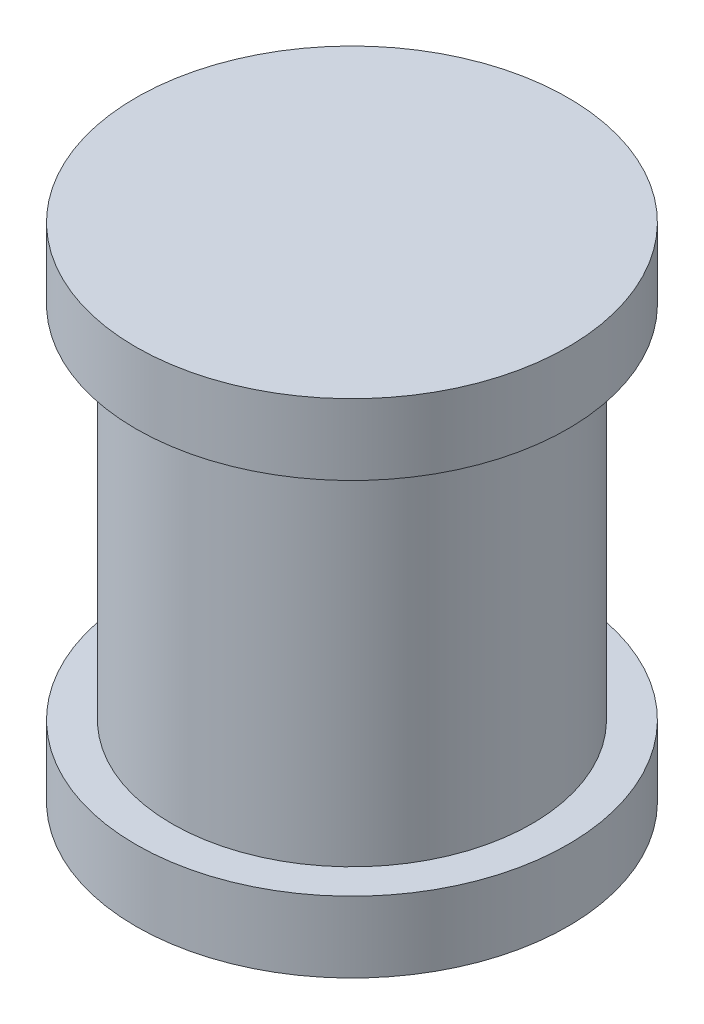
ISO-10303-21;
HEADER;
FILE_DESCRIPTION(('STEP AP214'),'2;1');
FILE_NAME('part.step','',(''),(''),'','','');
FILE_SCHEMA(('AUTOMOTIVE_DESIGN { 1 0 10303 214 1 1 1 1 }'));
ENDSEC;
DATA;
#1=APPLICATION_CONTEXT('core data for automotive mechanical design processes');
#2=APPLICATION_PROTOCOL_DEFINITION('international standard','automotive_design',2000,#1);
#3=PRODUCT_CONTEXT('',#1,'mechanical');
#4=PRODUCT('Part','Part','',(#3));
#5=PRODUCT_RELATED_PRODUCT_CATEGORY('part','',(#4));
#6=PRODUCT_DEFINITION_FORMATION('','',#4);
#7=PRODUCT_DEFINITION_CONTEXT('part definition',#1,'design');
#8=PRODUCT_DEFINITION('design','',#6,#7);
#9=PRODUCT_DEFINITION_SHAPE('','',#8);
#10=(LENGTH_UNIT() NAMED_UNIT(*) SI_UNIT(.MILLI.,.METRE.));
#11=(NAMED_UNIT(*) PLANE_ANGLE_UNIT() SI_UNIT($,.RADIAN.));
#12=(NAMED_UNIT(*) SI_UNIT($,.STERADIAN.) SOLID_ANGLE_UNIT());
#13=UNCERTAINTY_MEASURE_WITH_UNIT(LENGTH_MEASURE(1.E-05),#10,'distance_accuracy_value','');
#14=(GEOMETRIC_REPRESENTATION_CONTEXT(3) GLOBAL_UNCERTAINTY_ASSIGNED_CONTEXT((#13)) GLOBAL_UNIT_ASSIGNED_CONTEXT((#10,
#11,#12)) REPRESENTATION_CONTEXT('',''));
#15=CARTESIAN_POINT('',(0.,0.,0.));
#16=DIRECTION('',(0.,0.,1.));
#17=DIRECTION('',(1.,0.,0.));
#18=AXIS2_PLACEMENT_3D('',#15,#16,#17);
#19=CARTESIAN_POINT('',(0.,12.7,0.));
#20=DIRECTION('',(0.,-1.,0.));
#21=DIRECTION('',(0.,0.,-1.));
#22=AXIS2_PLACEMENT_3D('',#19,#20,#21);
#23=CYLINDRICAL_SURFACE('',#22,12.7);
#24=CARTESIAN_POINT('',(0.,12.7,0.));
#25=DIRECTION('',(0.,1.,0.));
#26=DIRECTION('',(0.,0.,1.));
#27=AXIS2_PLACEMENT_3D('',#24,#25,#26);
#28=CIRCLE('',#27,12.7);
#29=CARTESIAN_POINT('',(0.,12.7,12.7));
#30=VERTEX_POINT('',#29);
#31=EDGE_CURVE('E10',#30,#30,#28,.T.);
#32=ORIENTED_EDGE('',*,*,#31,.F.);
#33=EDGE_LOOP('',(#32));
#34=FACE_BOUND('',#33,.T.);
#35=CARTESIAN_POINT('',(0.,-12.7,0.));
#36=DIRECTION('',(0.,1.,0.));
#37=DIRECTION('',(0.,0.,1.));
#38=AXIS2_PLACEMENT_3D('',#35,#36,#37);
#39=CIRCLE('',#38,12.7);
#40=CARTESIAN_POINT('',(0.,-12.7,12.7));
#41=VERTEX_POINT('',#40);
#42=EDGE_CURVE('E35',#41,#41,#39,.T.);
#43=ORIENTED_EDGE('',*,*,#42,.T.);
#44=EDGE_LOOP('',(#43));
#45=FACE_BOUND('',#44,.T.);
#46=ADVANCED_FACE('F32',(#34,#45),#23,.T.);
#47=CARTESIAN_POINT('',(0.,17.7,0.));
#48=DIRECTION('',(0.,-1.,0.));
#49=DIRECTION('',(0.,0.,-1.));
#50=AXIS2_PLACEMENT_3D('',#47,#48,#49);
#51=CYLINDRICAL_SURFACE('',#50,15.24);
#52=CARTESIAN_POINT('',(0.,17.7,0.));
#53=DIRECTION('',(0.,1.,0.));
#54=DIRECTION('',(0.,0.,1.));
#55=AXIS2_PLACEMENT_3D('',#52,#53,#54);
#56=CIRCLE('',#55,15.24);
#57=CARTESIAN_POINT('',(0.,17.7,15.24));
#58=VERTEX_POINT('',#57);
#59=EDGE_CURVE('E39',#58,#58,#56,.T.);
#60=ORIENTED_EDGE('',*,*,#59,.F.);
#61=EDGE_LOOP('',(#60));
#62=FACE_BOUND('',#61,.T.);
#63=CARTESIAN_POINT('',(0.,12.7,0.));
#64=DIRECTION('',(0.,1.,0.));
#65=DIRECTION('',(0.,0.,1.));
#66=AXIS2_PLACEMENT_3D('',#63,#64,#65);
#67=CIRCLE('',#66,15.24);
#68=CARTESIAN_POINT('',(0.,12.7,15.24));
#69=VERTEX_POINT('',#68);
#70=EDGE_CURVE('E43',#69,#69,#67,.T.);
#71=ORIENTED_EDGE('',*,*,#70,.T.);
#72=EDGE_LOOP('',(#71));
#73=FACE_BOUND('',#72,.T.);
#74=ADVANCED_FACE('F80',(#62,#73),#51,.T.);
#75=CARTESIAN_POINT('',(0.,17.7,0.));
#76=DIRECTION('',(0.,1.,0.));
#77=DIRECTION('',(0.,0.,1.));
#78=AXIS2_PLACEMENT_3D('',#75,#76,#77);
#79=PLANE('',#78);
#80=ORIENTED_EDGE('',*,*,#59,.T.);
#81=EDGE_LOOP('',(#80));
#82=FACE_BOUND('',#81,.T.);
#83=ADVANCED_FACE('F76',(#82),#79,.T.);
#84=CARTESIAN_POINT('',(0.,12.7,0.));
#85=DIRECTION('',(0.,1.,0.));
#86=DIRECTION('',(0.,0.,1.));
#87=AXIS2_PLACEMENT_3D('',#84,#85,#86);
#88=PLANE('',#87);
#89=ORIENTED_EDGE('',*,*,#31,.T.);
#90=EDGE_LOOP('',(#89));
#91=FACE_BOUND('',#90,.T.);
#92=ORIENTED_EDGE('',*,*,#70,.F.);
#93=EDGE_LOOP('',(#92));
#94=FACE_BOUND('',#93,.T.);
#95=ADVANCED_FACE('F68',(#91,#94),#88,.F.);
#96=CARTESIAN_POINT('',(0.,-17.7,0.));
#97=DIRECTION('',(0.,1.,0.));
#98=DIRECTION('',(0.,0.,1.));
#99=AXIS2_PLACEMENT_3D('',#96,#97,#98);
#100=CYLINDRICAL_SURFACE('',#99,15.24);
#101=CARTESIAN_POINT('',(0.,-17.7,0.));
#102=DIRECTION('',(0.,1.,0.));
#103=DIRECTION('',(0.,0.,1.));
#104=AXIS2_PLACEMENT_3D('',#101,#102,#103);
#105=CIRCLE('',#104,15.24);
#106=CARTESIAN_POINT('',(0.,-17.7,15.24));
#107=VERTEX_POINT('',#106);
#108=EDGE_CURVE('E51',#107,#107,#105,.T.);
#109=ORIENTED_EDGE('',*,*,#108,.T.);
#110=EDGE_LOOP('',(#109));
#111=FACE_BOUND('',#110,.T.);
#112=CARTESIAN_POINT('',(0.,-12.7,0.));
#113=DIRECTION('',(0.,1.,0.));
#114=DIRECTION('',(0.,0.,1.));
#115=AXIS2_PLACEMENT_3D('',#112,#113,#114);
#116=CIRCLE('',#115,15.24);
#117=CARTESIAN_POINT('',(0.,-12.7,15.24));
#118=VERTEX_POINT('',#117);
#119=EDGE_CURVE('E48',#118,#118,#116,.T.);
#120=ORIENTED_EDGE('',*,*,#119,.F.);
#121=EDGE_LOOP('',(#120));
#122=FACE_BOUND('',#121,.T.);
#123=ADVANCED_FACE('F66',(#111,#122),#100,.T.);
#124=CARTESIAN_POINT('',(0.,-17.7,0.));
#125=DIRECTION('',(0.,-1.,0.));
#126=DIRECTION('',(0.,0.,1.));
#127=AXIS2_PLACEMENT_3D('',#124,#125,#126);
#128=PLANE('',#127);
#129=ORIENTED_EDGE('',*,*,#108,.F.);
#130=EDGE_LOOP('',(#129));
#131=FACE_BOUND('',#130,.T.);
#132=ADVANCED_FACE('F62',(#131),#128,.T.);
#133=CARTESIAN_POINT('',(0.,-12.7,0.));
#134=DIRECTION('',(0.,-1.,0.));
#135=DIRECTION('',(0.,0.,1.));
#136=AXIS2_PLACEMENT_3D('',#133,#134,#135);
#137=PLANE('',#136);
#138=ORIENTED_EDGE('',*,*,#42,.F.);
#139=EDGE_LOOP('',(#138));
#140=FACE_BOUND('',#139,.T.);
#141=ORIENTED_EDGE('',*,*,#119,.T.);
#142=EDGE_LOOP('',(#141));
#143=FACE_BOUND('',#142,.T.);
#144=ADVANCED_FACE('F59',(#140,#143),#137,.F.);
#145=CLOSED_SHELL('',(#46,#74,#83,#95,#123,#132,#144));
#146=MANIFOLD_SOLID_BREP('B2',#145);
#147=ADVANCED_BREP_SHAPE_REPRESENTATION('',(#18,#146),#14);
#148=SHAPE_DEFINITION_REPRESENTATION(#9,#147);
ENDSEC;
END-ISO-10303-21;
